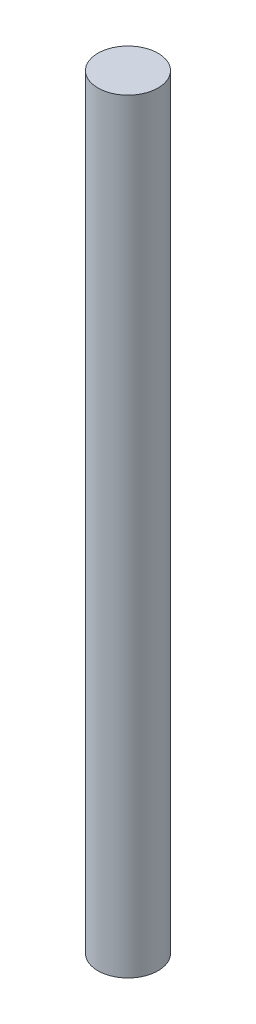
ISO-10303-21;
HEADER;
FILE_DESCRIPTION(('STEP AP214'),'2;1');
FILE_NAME('part.step','',(''),(''),'','','');
FILE_SCHEMA(('AUTOMOTIVE_DESIGN { 1 0 10303 214 1 1 1 1 }'));
ENDSEC;
DATA;
#1=APPLICATION_CONTEXT('core data for automotive mechanical design processes');
#2=APPLICATION_PROTOCOL_DEFINITION('international standard','automotive_design',2000,#1);
#3=PRODUCT_CONTEXT('',#1,'mechanical');
#4=PRODUCT('Part','Part','',(#3));
#5=PRODUCT_RELATED_PRODUCT_CATEGORY('part','',(#4));
#6=PRODUCT_DEFINITION_FORMATION('','',#4);
#7=PRODUCT_DEFINITION_CONTEXT('part definition',#1,'design');
#8=PRODUCT_DEFINITION('design','',#6,#7);
#9=PRODUCT_DEFINITION_SHAPE('','',#8);
#10=(LENGTH_UNIT() NAMED_UNIT(*) SI_UNIT(.MILLI.,.METRE.));
#11=(NAMED_UNIT(*) PLANE_ANGLE_UNIT() SI_UNIT($,.RADIAN.));
#12=(NAMED_UNIT(*) SI_UNIT($,.STERADIAN.) SOLID_ANGLE_UNIT());
#13=UNCERTAINTY_MEASURE_WITH_UNIT(LENGTH_MEASURE(1.E-05),#10,'distance_accuracy_value','');
#14=(GEOMETRIC_REPRESENTATION_CONTEXT(3) GLOBAL_UNCERTAINTY_ASSIGNED_CONTEXT((#13)) GLOBAL_UNIT_ASSIGNED_CONTEXT((#10,
#11,#12)) REPRESENTATION_CONTEXT('',''));
#15=CARTESIAN_POINT('',(0.,0.,0.));
#16=DIRECTION('',(0.,0.,1.));
#17=DIRECTION('',(1.,0.,0.));
#18=AXIS2_PLACEMENT_3D('',#15,#16,#17);
#19=CARTESIAN_POINT('',(0.,38.1,0.));
#20=DIRECTION('',(0.,-1.,0.));
#21=DIRECTION('',(0.,0.,-1.));
#22=AXIS2_PLACEMENT_3D('',#19,#20,#21);
#23=CYLINDRICAL_SURFACE('',#22,1.5);
#24=CARTESIAN_POINT('',(0.,38.1,0.));
#25=DIRECTION('',(0.,1.,0.));
#26=DIRECTION('',(0.,0.,1.));
#27=AXIS2_PLACEMENT_3D('',#24,#25,#26);
#28=CIRCLE('',#27,1.5);
#29=CARTESIAN_POINT('',(0.,38.1,1.5));
#30=VERTEX_POINT('',#29);
#31=EDGE_CURVE('E10',#30,#30,#28,.T.);
#32=ORIENTED_EDGE('',*,*,#31,.F.);
#33=EDGE_LOOP('',(#32));
#34=FACE_BOUND('',#33,.T.);
#35=CARTESIAN_POINT('',(0.,0.,0.));
#36=DIRECTION('',(0.,1.,0.));
#37=DIRECTION('',(0.,0.,1.));
#38=AXIS2_PLACEMENT_3D('',#35,#36,#37);
#39=CIRCLE('',#38,1.5);
#40=CARTESIAN_POINT('',(0.,0.,1.5));
#41=VERTEX_POINT('',#40);
#42=EDGE_CURVE('E35',#41,#41,#39,.T.);
#43=ORIENTED_EDGE('',*,*,#42,.T.);
#44=EDGE_LOOP('',(#43));
#45=FACE_BOUND('',#44,.T.);
#46=ADVANCED_FACE('F32',(#34,#45),#23,.T.);
#47=CARTESIAN_POINT('',(0.,38.1,0.));
#48=DIRECTION('',(0.,1.,0.));
#49=DIRECTION('',(0.,0.,1.));
#50=AXIS2_PLACEMENT_3D('',#47,#48,#49);
#51=PLANE('',#50);
#52=ORIENTED_EDGE('',*,*,#31,.T.);
#53=EDGE_LOOP('',(#52));
#54=FACE_BOUND('',#53,.T.);
#55=ADVANCED_FACE('F47',(#54),#51,.T.);
#56=CARTESIAN_POINT('',(0.,0.,0.));
#57=DIRECTION('',(0.,1.,0.));
#58=DIRECTION('',(0.,0.,1.));
#59=AXIS2_PLACEMENT_3D('',#56,#57,#58);
#60=PLANE('',#59);
#61=ORIENTED_EDGE('',*,*,#42,.F.);
#62=EDGE_LOOP('',(#61));
#63=FACE_BOUND('',#62,.T.);
#64=ADVANCED_FACE('F45',(#63),#60,.F.);
#65=CLOSED_SHELL('',(#46,#55,#64));
#66=MANIFOLD_SOLID_BREP('B2',#65);
#67=ADVANCED_BREP_SHAPE_REPRESENTATION('',(#18,#66),#14);
#68=SHAPE_DEFINITION_REPRESENTATION(#9,#67);
ENDSEC;
END-ISO-10303-21;
